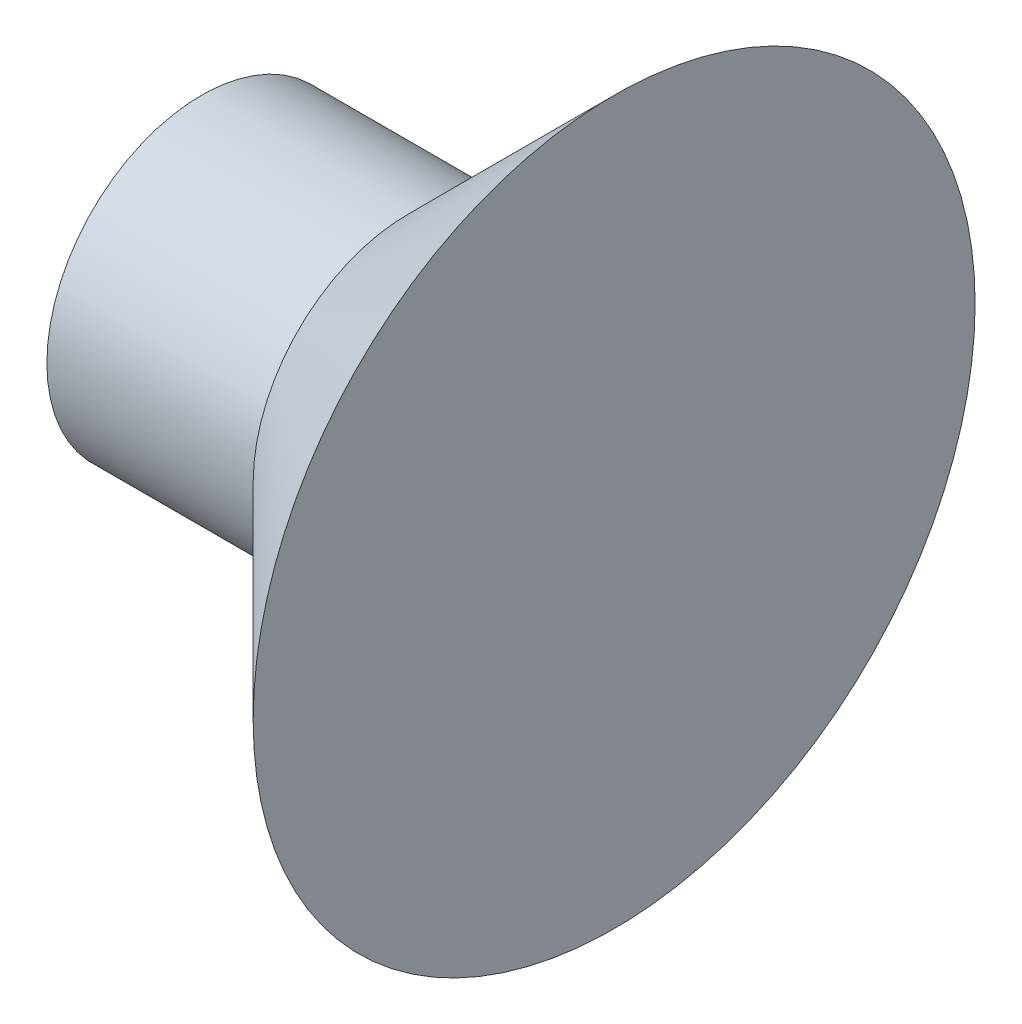
ISO-10303-21;
HEADER;
FILE_DESCRIPTION(('STEP AP214'),'2;1');
FILE_NAME('part.step','',(''),(''),'','','');
FILE_SCHEMA(('AUTOMOTIVE_DESIGN { 1 0 10303 214 1 1 1 1 }'));
ENDSEC;
DATA;
#1=APPLICATION_CONTEXT('core data for automotive mechanical design processes');
#2=APPLICATION_PROTOCOL_DEFINITION('international standard','automotive_design',2000,#1);
#3=PRODUCT_CONTEXT('',#1,'mechanical');
#4=PRODUCT('Part','Part','',(#3));
#5=PRODUCT_RELATED_PRODUCT_CATEGORY('part','',(#4));
#6=PRODUCT_DEFINITION_FORMATION('','',#4);
#7=PRODUCT_DEFINITION_CONTEXT('part definition',#1,'design');
#8=PRODUCT_DEFINITION('design','',#6,#7);
#9=PRODUCT_DEFINITION_SHAPE('','',#8);
#10=(LENGTH_UNIT() NAMED_UNIT(*) SI_UNIT(.MILLI.,.METRE.));
#11=(NAMED_UNIT(*) PLANE_ANGLE_UNIT() SI_UNIT($,.RADIAN.));
#12=(NAMED_UNIT(*) SI_UNIT($,.STERADIAN.) SOLID_ANGLE_UNIT());
#13=UNCERTAINTY_MEASURE_WITH_UNIT(LENGTH_MEASURE(1.E-05),#10,'distance_accuracy_value','');
#14=(GEOMETRIC_REPRESENTATION_CONTEXT(3) GLOBAL_UNCERTAINTY_ASSIGNED_CONTEXT((#13)) GLOBAL_UNIT_ASSIGNED_CONTEXT((#10,
#11,#12)) REPRESENTATION_CONTEXT('',''));
#15=CARTESIAN_POINT('',(0.,0.,0.));
#16=DIRECTION('',(0.,0.,1.));
#17=DIRECTION('',(1.,0.,0.));
#18=AXIS2_PLACEMENT_3D('',#15,#16,#17);
#19=CARTESIAN_POINT('',(0.,3.49999999999998,0.));
#20=DIRECTION('',(-1.,0.,0.));
#21=DIRECTION('',(0.,0.,1.));
#22=AXIS2_PLACEMENT_3D('',#19,#20,#21);
#23=PLANE('',#22);
#24=CARTESIAN_POINT('',(0.,0.,0.));
#25=DIRECTION('',(-1.,0.,0.));
#26=DIRECTION('',(0.,0.,1.));
#27=AXIS2_PLACEMENT_3D('',#24,#25,#26);
#28=CIRCLE('',#27,3.49999999999998);
#29=CARTESIAN_POINT('',(0.,0.,3.49999999999998));
#30=VERTEX_POINT('',#29);
#31=EDGE_CURVE('E10',#30,#30,#28,.T.);
#32=ORIENTED_EDGE('',*,*,#31,.F.);
#33=EDGE_LOOP('',(#32));
#34=FACE_BOUND('',#33,.T.);
#35=ADVANCED_FACE('F24',(#34),#23,.F.);
#36=CARTESIAN_POINT('',(0.,0.,0.));
#37=DIRECTION('',(1.,0.,0.));
#38=DIRECTION('',(0.,0.,-1.));
#39=AXIS2_PLACEMENT_3D('',#36,#37,#38);
#40=CONICAL_SURFACE('',#39,3.49999999999998,0.785398163397443);
#41=CARTESIAN_POINT('',(-2.,0.,0.));
#42=DIRECTION('',(-1.,0.,0.));
#43=DIRECTION('',(0.,0.,1.));
#44=AXIS2_PLACEMENT_3D('',#41,#42,#43);
#45=CIRCLE('',#44,1.5);
#46=CARTESIAN_POINT('',(-2.,0.,1.5));
#47=VERTEX_POINT('',#46);
#48=EDGE_CURVE('E30',#47,#47,#45,.T.);
#49=ORIENTED_EDGE('',*,*,#48,.F.);
#50=EDGE_LOOP('',(#49));
#51=FACE_BOUND('',#50,.T.);
#52=ORIENTED_EDGE('',*,*,#31,.T.);
#53=EDGE_LOOP('',(#52));
#54=FACE_BOUND('',#53,.T.);
#55=ADVANCED_FACE('F45',(#51,#54),#40,.T.);
#56=CARTESIAN_POINT('',(0.,0.,0.));
#57=DIRECTION('',(-1.,0.,0.));
#58=DIRECTION('',(0.,0.,1.));
#59=AXIS2_PLACEMENT_3D('',#56,#57,#58);
#60=CYLINDRICAL_SURFACE('',#59,1.5);
#61=CARTESIAN_POINT('',(-4.,0.,0.));
#62=DIRECTION('',(-1.,0.,0.));
#63=DIRECTION('',(0.,0.,1.));
#64=AXIS2_PLACEMENT_3D('',#61,#62,#63);
#65=CIRCLE('',#64,1.5);
#66=CARTESIAN_POINT('',(-4.,0.,1.5));
#67=VERTEX_POINT('',#66);
#68=EDGE_CURVE('E34',#67,#67,#65,.T.);
#69=ORIENTED_EDGE('',*,*,#68,.F.);
#70=EDGE_LOOP('',(#69));
#71=FACE_BOUND('',#70,.T.);
#72=ORIENTED_EDGE('',*,*,#48,.T.);
#73=EDGE_LOOP('',(#72));
#74=FACE_BOUND('',#73,.T.);
#75=ADVANCED_FACE('F43',(#71,#74),#60,.T.);
#76=CARTESIAN_POINT('',(-4.,0.,0.));
#77=DIRECTION('',(1.,0.,0.));
#78=DIRECTION('',(0.,0.,-1.));
#79=AXIS2_PLACEMENT_3D('',#76,#77,#78);
#80=PLANE('',#79);
#81=ORIENTED_EDGE('',*,*,#68,.T.);
#82=EDGE_LOOP('',(#81));
#83=FACE_BOUND('',#82,.T.);
#84=ADVANCED_FACE('F41',(#83),#80,.F.);
#85=CLOSED_SHELL('',(#35,#55,#75,#84));
#86=MANIFOLD_SOLID_BREP('B2',#85);
#87=ADVANCED_BREP_SHAPE_REPRESENTATION('',(#18,#86),#14);
#88=SHAPE_DEFINITION_REPRESENTATION(#9,#87);
ENDSEC;
END-ISO-10303-21;
